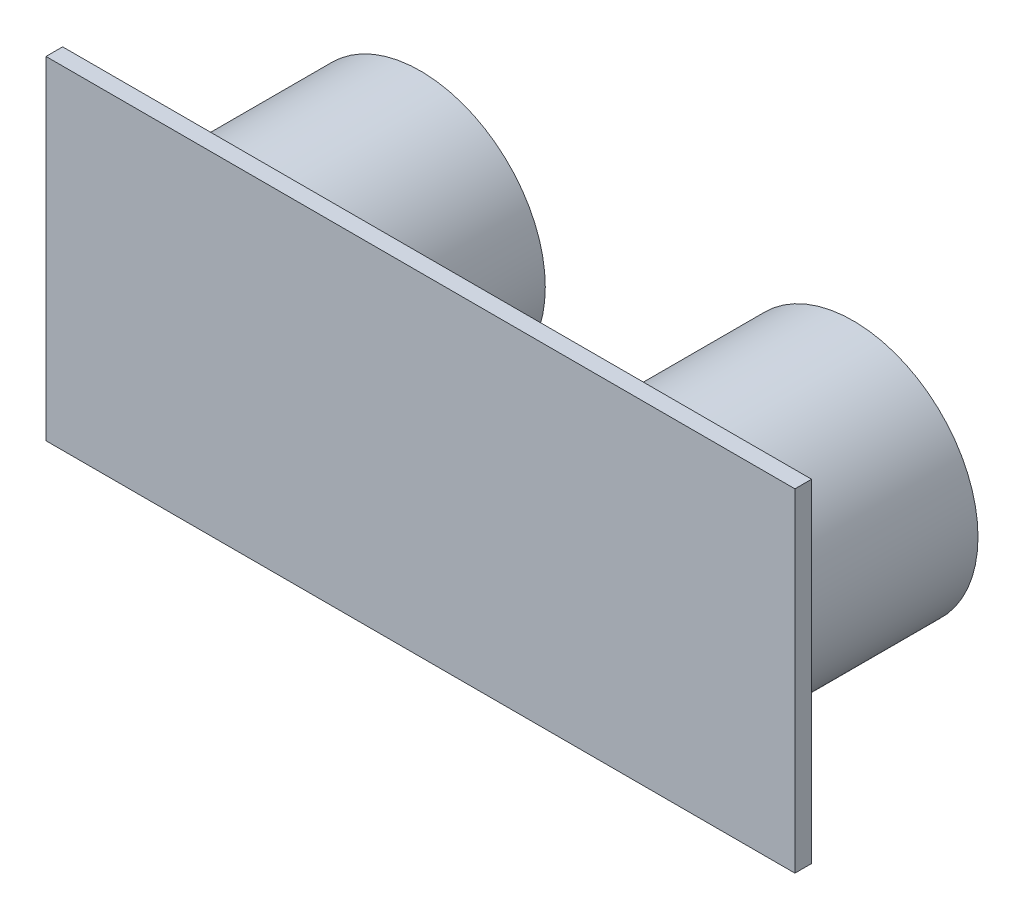
ISO-10303-21;
HEADER;
FILE_DESCRIPTION(('STEP AP214'),'2;1');
FILE_NAME('part.step','',(''),(''),'','','');
FILE_SCHEMA(('AUTOMOTIVE_DESIGN { 1 0 10303 214 1 1 1 1 }'));
ENDSEC;
DATA;
#1=APPLICATION_CONTEXT('core data for automotive mechanical design processes');
#2=APPLICATION_PROTOCOL_DEFINITION('international standard','automotive_design',2000,#1);
#3=PRODUCT_CONTEXT('',#1,'mechanical');
#4=PRODUCT('Part','Part','',(#3));
#5=PRODUCT_RELATED_PRODUCT_CATEGORY('part','',(#4));
#6=PRODUCT_DEFINITION_FORMATION('','',#4);
#7=PRODUCT_DEFINITION_CONTEXT('part definition',#1,'design');
#8=PRODUCT_DEFINITION('design','',#6,#7);
#9=PRODUCT_DEFINITION_SHAPE('','',#8);
#10=(LENGTH_UNIT() NAMED_UNIT(*) SI_UNIT(.MILLI.,.METRE.));
#11=(NAMED_UNIT(*) PLANE_ANGLE_UNIT() SI_UNIT($,.RADIAN.));
#12=(NAMED_UNIT(*) SI_UNIT($,.STERADIAN.) SOLID_ANGLE_UNIT());
#13=UNCERTAINTY_MEASURE_WITH_UNIT(LENGTH_MEASURE(1.E-05),#10,'distance_accuracy_value','');
#14=(GEOMETRIC_REPRESENTATION_CONTEXT(3) GLOBAL_UNCERTAINTY_ASSIGNED_CONTEXT((#13)) GLOBAL_UNIT_ASSIGNED_CONTEXT((#10,
#11,#12)) REPRESENTATION_CONTEXT('',''));
#15=CARTESIAN_POINT('',(0.,0.,0.));
#16=DIRECTION('',(0.,0.,1.));
#17=DIRECTION('',(1.,0.,0.));
#18=AXIS2_PLACEMENT_3D('',#15,#16,#17);
#19=CARTESIAN_POINT('',(-16.4726688102894,2.25884244372991,-12.));
#20=DIRECTION('',(0.,0.,1.));
#21=DIRECTION('',(1.,0.,0.));
#22=AXIS2_PLACEMENT_3D('',#19,#20,#21);
#23=CYLINDRICAL_SURFACE('',#22,6.5);
#24=CARTESIAN_POINT('',(-16.4726688102894,2.25884244372991,-12.));
#25=DIRECTION('',(0.,0.,1.));
#26=DIRECTION('',(1.,0.,0.));
#27=AXIS2_PLACEMENT_3D('',#24,#25,#26);
#28=CIRCLE('',#27,6.5);
#29=CARTESIAN_POINT('',(-9.97266881028938,2.25884244372991,-12.));
#30=VERTEX_POINT('',#29);
#31=EDGE_CURVE('E255',#30,#30,#28,.T.);
#32=ORIENTED_EDGE('',*,*,#31,.F.);
#33=EDGE_LOOP('',(#32));
#34=FACE_BOUND('',#33,.T.);
#35=CARTESIAN_POINT('',(-16.4726688102894,2.25884244372991,-10.));
#36=DIRECTION('',(0.,0.,1.));
#37=DIRECTION('',(1.,0.,0.));
#38=AXIS2_PLACEMENT_3D('',#35,#36,#37);
#39=CIRCLE('',#38,6.5);
#40=CARTESIAN_POINT('',(-9.97266881028938,2.25884244372991,-10.));
#41=VERTEX_POINT('',#40);
#42=EDGE_CURVE('E11',#41,#41,#39,.F.);
#43=ORIENTED_EDGE('',*,*,#42,.F.);
#44=EDGE_LOOP('',(#43));
#45=FACE_BOUND('',#44,.T.);
#46=ADVANCED_FACE('F32',(#34,#45),#23,.F.);
#47=CARTESIAN_POINT('',(9.52733118971062,2.25884244372991,-12.));
#48=DIRECTION('',(0.,0.,1.));
#49=DIRECTION('',(1.,0.,0.));
#50=AXIS2_PLACEMENT_3D('',#47,#48,#49);
#51=CYLINDRICAL_SURFACE('',#50,6.5);
#52=CARTESIAN_POINT('',(9.52733118971062,2.25884244372991,-12.));
#53=DIRECTION('',(0.,0.,1.));
#54=DIRECTION('',(1.,0.,0.));
#55=AXIS2_PLACEMENT_3D('',#52,#53,#54);
#56=CIRCLE('',#55,6.5);
#57=CARTESIAN_POINT('',(16.0273311897106,2.25884244372991,-12.));
#58=VERTEX_POINT('',#57);
#59=EDGE_CURVE('E262',#58,#58,#56,.T.);
#60=ORIENTED_EDGE('',*,*,#59,.F.);
#61=EDGE_LOOP('',(#60));
#62=FACE_BOUND('',#61,.T.);
#63=CARTESIAN_POINT('',(9.52733118971062,2.25884244372991,-10.));
#64=DIRECTION('',(0.,0.,1.));
#65=DIRECTION('',(1.,0.,0.));
#66=AXIS2_PLACEMENT_3D('',#63,#64,#65);
#67=CIRCLE('',#66,6.5);
#68=CARTESIAN_POINT('',(16.0273311897106,2.25884244372991,-10.));
#69=VERTEX_POINT('',#68);
#70=EDGE_CURVE('E41',#69,#69,#67,.F.);
#71=ORIENTED_EDGE('',*,*,#70,.F.);
#72=EDGE_LOOP('',(#71));
#73=FACE_BOUND('',#72,.T.);
#74=ADVANCED_FACE('F114',(#62,#73),#51,.F.);
#75=CARTESIAN_POINT('',(-25.9726688102894,12.2588424437299,1.));
#76=DIRECTION('',(1.,0.,0.));
#77=DIRECTION('',(0.,1.,0.));
#78=AXIS2_PLACEMENT_3D('',#75,#76,#77);
#79=PLANE('',#78);
#80=DIRECTION('',(0.,-1.,0.));
#81=VECTOR('',#80,1.);
#82=CARTESIAN_POINT('',(-25.9726688102894,12.2588424437299,0.));
#83=LINE('',#82,#81);
#84=CARTESIAN_POINT('',(-25.9726688102894,12.2588424437299,0.));
#85=VERTEX_POINT('',#84);
#86=CARTESIAN_POINT('',(-25.9726688102894,-7.74115755627009,0.));
#87=VERTEX_POINT('',#86);
#88=EDGE_CURVE('E100',#85,#87,#83,.T.);
#89=ORIENTED_EDGE('',*,*,#88,.T.);
#90=DIRECTION('',(0.,0.,-1.));
#91=VECTOR('',#90,1.);
#92=CARTESIAN_POINT('',(-25.9726688102894,-7.74115755627009,1.));
#93=LINE('',#92,#91);
#94=CARTESIAN_POINT('',(-25.9726688102894,-7.74115755627009,1.));
#95=VERTEX_POINT('',#94);
#96=EDGE_CURVE('E91',#95,#87,#93,.T.);
#97=ORIENTED_EDGE('',*,*,#96,.F.);
#98=DIRECTION('',(0.,-1.,0.));
#99=VECTOR('',#98,1.);
#100=CARTESIAN_POINT('',(-25.9726688102894,12.2588424437299,1.));
#101=LINE('',#100,#99);
#102=CARTESIAN_POINT('',(-25.9726688102894,12.2588424437299,1.));
#103=VERTEX_POINT('',#102);
#104=EDGE_CURVE('E85',#103,#95,#101,.T.);
#105=ORIENTED_EDGE('',*,*,#104,.F.);
#106=DIRECTION('',(0.,0.,-1.));
#107=VECTOR('',#106,1.);
#108=CARTESIAN_POINT('',(-25.9726688102894,12.2588424437299,1.));
#109=LINE('',#108,#107);
#110=EDGE_CURVE('E96',#103,#85,#109,.T.);
#111=ORIENTED_EDGE('',*,*,#110,.T.);
#112=EDGE_LOOP('',(#89,#97,#105,#111));
#113=FACE_BOUND('',#112,.T.);
#114=ADVANCED_FACE('F34',(#113),#79,.F.);
#115=CARTESIAN_POINT('',(-25.9726688102894,-7.74115755627009,1.));
#116=DIRECTION('',(0.,1.,0.));
#117=DIRECTION('',(0.,0.,1.));
#118=AXIS2_PLACEMENT_3D('',#115,#116,#117);
#119=PLANE('',#118);
#120=DIRECTION('',(1.,0.,0.));
#121=VECTOR('',#120,1.);
#122=CARTESIAN_POINT('',(-25.9726688102894,-7.74115755627009,0.));
#123=LINE('',#122,#121);
#124=CARTESIAN_POINT('',(19.0273311897106,-7.74115755627009,0.));
#125=VERTEX_POINT('',#124);
#126=EDGE_CURVE('E90',#87,#125,#123,.T.);
#127=ORIENTED_EDGE('',*,*,#126,.T.);
#128=DIRECTION('',(0.,0.,-1.));
#129=VECTOR('',#128,1.);
#130=CARTESIAN_POINT('',(19.0273311897106,-7.74115755627009,1.));
#131=LINE('',#130,#129);
#132=CARTESIAN_POINT('',(19.0273311897106,-7.74115755627009,1.));
#133=VERTEX_POINT('',#132);
#134=EDGE_CURVE('E88',#133,#125,#131,.T.);
#135=ORIENTED_EDGE('',*,*,#134,.F.);
#136=DIRECTION('',(1.,0.,0.));
#137=VECTOR('',#136,1.);
#138=CARTESIAN_POINT('',(-25.9726688102894,-7.74115755627009,1.));
#139=LINE('',#138,#137);
#140=EDGE_CURVE('E80',#95,#133,#139,.T.);
#141=ORIENTED_EDGE('',*,*,#140,.F.);
#142=ORIENTED_EDGE('',*,*,#96,.T.);
#143=EDGE_LOOP('',(#127,#135,#141,#142));
#144=FACE_BOUND('',#143,.T.);
#145=ADVANCED_FACE('F89',(#144),#119,.F.);
#146=CARTESIAN_POINT('',(19.0273311897106,12.2588424437299,1.));
#147=DIRECTION('',(-1.,0.,0.));
#148=DIRECTION('',(0.,0.,1.));
#149=AXIS2_PLACEMENT_3D('',#146,#147,#148);
#150=PLANE('',#149);
#151=DIRECTION('',(0.,1.,0.));
#152=VECTOR('',#151,1.);
#153=CARTESIAN_POINT('',(19.0273311897106,12.2588424437299,0.));
#154=LINE('',#153,#152);
#155=CARTESIAN_POINT('',(19.0273311897106,12.2588424437299,0.));
#156=VERTEX_POINT('',#155);
#157=EDGE_CURVE('E66',#125,#156,#154,.T.);
#158=ORIENTED_EDGE('',*,*,#157,.T.);
#159=DIRECTION('',(0.,0.,-1.));
#160=VECTOR('',#159,1.);
#161=CARTESIAN_POINT('',(19.0273311897106,12.2588424437299,1.));
#162=LINE('',#161,#160);
#163=CARTESIAN_POINT('',(19.0273311897106,12.2588424437299,1.));
#164=VERTEX_POINT('',#163);
#165=EDGE_CURVE('E92',#164,#156,#162,.T.);
#166=ORIENTED_EDGE('',*,*,#165,.F.);
#167=DIRECTION('',(0.,1.,0.));
#168=VECTOR('',#167,1.);
#169=CARTESIAN_POINT('',(19.0273311897106,12.2588424437299,1.));
#170=LINE('',#169,#168);
#171=EDGE_CURVE('E83',#133,#164,#170,.T.);
#172=ORIENTED_EDGE('',*,*,#171,.F.);
#173=ORIENTED_EDGE('',*,*,#134,.T.);
#174=EDGE_LOOP('',(#158,#166,#172,#173));
#175=FACE_BOUND('',#174,.T.);
#176=ADVANCED_FACE('F94',(#175),#150,.F.);
#177=CARTESIAN_POINT('',(-25.9726688102894,12.2588424437299,1.));
#178=DIRECTION('',(0.,-1.,0.));
#179=DIRECTION('',(0.,0.,-1.));
#180=AXIS2_PLACEMENT_3D('',#177,#178,#179);
#181=PLANE('',#180);
#182=DIRECTION('',(-1.,0.,0.));
#183=VECTOR('',#182,1.);
#184=CARTESIAN_POINT('',(-25.9726688102894,12.2588424437299,0.));
#185=LINE('',#184,#183);
#186=EDGE_CURVE('E72',#156,#85,#185,.T.);
#187=ORIENTED_EDGE('',*,*,#186,.T.);
#188=ORIENTED_EDGE('',*,*,#110,.F.);
#189=DIRECTION('',(-1.,0.,0.));
#190=VECTOR('',#189,1.);
#191=CARTESIAN_POINT('',(-25.9726688102894,12.2588424437299,1.));
#192=LINE('',#191,#190);
#193=EDGE_CURVE('E49',#164,#103,#192,.T.);
#194=ORIENTED_EDGE('',*,*,#193,.F.);
#195=ORIENTED_EDGE('',*,*,#165,.T.);
#196=EDGE_LOOP('',(#187,#188,#194,#195));
#197=FACE_BOUND('',#196,.T.);
#198=ADVANCED_FACE('F148',(#197),#181,.F.);
#199=CARTESIAN_POINT('',(0.,0.,1.));
#200=DIRECTION('',(0.,0.,1.));
#201=DIRECTION('',(1.,0.,0.));
#202=AXIS2_PLACEMENT_3D('',#199,#200,#201);
#203=PLANE('',#202);
#204=ORIENTED_EDGE('',*,*,#104,.T.);
#205=ORIENTED_EDGE('',*,*,#140,.T.);
#206=ORIENTED_EDGE('',*,*,#171,.T.);
#207=ORIENTED_EDGE('',*,*,#193,.T.);
#208=EDGE_LOOP('',(#204,#205,#206,#207));
#209=FACE_BOUND('',#208,.T.);
#210=ADVANCED_FACE('F81',(#209),#203,.T.);
#211=CARTESIAN_POINT('',(0.,0.,0.));
#212=DIRECTION('',(0.,0.,1.));
#213=DIRECTION('',(1.,0.,0.));
#214=AXIS2_PLACEMENT_3D('',#211,#212,#213);
#215=PLANE('',#214);
#216=CARTESIAN_POINT('',(9.52733118971062,2.25884244372991,0.));
#217=DIRECTION('',(0.,0.,1.));
#218=DIRECTION('',(1.,0.,0.));
#219=AXIS2_PLACEMENT_3D('',#216,#217,#218);
#220=CIRCLE('',#219,7.5);
#221=CARTESIAN_POINT('',(17.0273311897106,2.25884244372991,0.));
#222=VERTEX_POINT('',#221);
#223=EDGE_CURVE('E247',#222,#222,#220,.T.);
#224=ORIENTED_EDGE('',*,*,#223,.T.);
#225=EDGE_LOOP('',(#224));
#226=FACE_BOUND('',#225,.T.);
#227=CARTESIAN_POINT('',(-16.4726688102894,2.25884244372991,0.));
#228=DIRECTION('',(0.,0.,1.));
#229=DIRECTION('',(1.,0.,0.));
#230=AXIS2_PLACEMENT_3D('',#227,#228,#229);
#231=CIRCLE('',#230,7.5);
#232=CARTESIAN_POINT('',(-8.97266881028938,2.25884244372991,0.));
#233=VERTEX_POINT('',#232);
#234=EDGE_CURVE('E251',#233,#233,#231,.T.);
#235=ORIENTED_EDGE('',*,*,#234,.T.);
#236=EDGE_LOOP('',(#235));
#237=FACE_BOUND('',#236,.T.);
#238=ORIENTED_EDGE('',*,*,#88,.F.);
#239=ORIENTED_EDGE('',*,*,#186,.F.);
#240=ORIENTED_EDGE('',*,*,#157,.F.);
#241=ORIENTED_EDGE('',*,*,#126,.F.);
#242=EDGE_LOOP('',(#238,#239,#240,#241));
#243=FACE_BOUND('',#242,.T.);
#244=ADVANCED_FACE('F144',(#226,#237,#243),#215,.F.);
#245=CARTESIAN_POINT('',(-16.4726688102894,2.25884244372991,-12.));
#246=DIRECTION('',(0.,0.,1.));
#247=DIRECTION('',(1.,0.,0.));
#248=AXIS2_PLACEMENT_3D('',#245,#246,#247);
#249=CYLINDRICAL_SURFACE('',#248,7.5);
#250=CARTESIAN_POINT('',(-16.4726688102894,2.25884244372991,-12.));
#251=DIRECTION('',(0.,0.,1.));
#252=DIRECTION('',(1.,0.,0.));
#253=AXIS2_PLACEMENT_3D('',#250,#251,#252);
#254=CIRCLE('',#253,7.5);
#255=CARTESIAN_POINT('',(-8.97266881028938,2.25884244372991,-12.));
#256=VERTEX_POINT('',#255);
#257=EDGE_CURVE('E103',#256,#256,#254,.T.);
#258=ORIENTED_EDGE('',*,*,#257,.T.);
#259=EDGE_LOOP('',(#258));
#260=FACE_BOUND('',#259,.T.);
#261=ORIENTED_EDGE('',*,*,#234,.F.);
#262=EDGE_LOOP('',(#261));
#263=FACE_BOUND('',#262,.T.);
#264=ADVANCED_FACE('F140',(#260,#263),#249,.T.);
#265=CARTESIAN_POINT('',(-16.4726688102894,2.25884244372991,-12.));
#266=DIRECTION('',(0.,0.,1.));
#267=DIRECTION('',(1.,0.,0.));
#268=AXIS2_PLACEMENT_3D('',#265,#266,#267);
#269=PLANE('',#268);
#270=ORIENTED_EDGE('',*,*,#31,.T.);
#271=EDGE_LOOP('',(#270));
#272=FACE_BOUND('',#271,.T.);
#273=ORIENTED_EDGE('',*,*,#257,.F.);
#274=EDGE_LOOP('',(#273));
#275=FACE_BOUND('',#274,.T.);
#276=ADVANCED_FACE('F135',(#272,#275),#269,.F.);
#277=CARTESIAN_POINT('',(9.52733118971062,2.25884244372991,-12.));
#278=DIRECTION('',(0.,0.,1.));
#279=DIRECTION('',(1.,0.,0.));
#280=AXIS2_PLACEMENT_3D('',#277,#278,#279);
#281=CYLINDRICAL_SURFACE('',#280,7.5);
#282=CARTESIAN_POINT('',(9.52733118971062,2.25884244372991,-12.));
#283=DIRECTION('',(0.,0.,1.));
#284=DIRECTION('',(1.,0.,0.));
#285=AXIS2_PLACEMENT_3D('',#282,#283,#284);
#286=CIRCLE('',#285,7.5);
#287=CARTESIAN_POINT('',(17.0273311897106,2.25884244372991,-12.));
#288=VERTEX_POINT('',#287);
#289=EDGE_CURVE('E260',#288,#288,#286,.T.);
#290=ORIENTED_EDGE('',*,*,#289,.T.);
#291=EDGE_LOOP('',(#290));
#292=FACE_BOUND('',#291,.T.);
#293=ORIENTED_EDGE('',*,*,#223,.F.);
#294=EDGE_LOOP('',(#293));
#295=FACE_BOUND('',#294,.T.);
#296=ADVANCED_FACE('F132',(#292,#295),#281,.T.);
#297=CARTESIAN_POINT('',(9.52733118971062,2.25884244372991,-12.));
#298=DIRECTION('',(0.,0.,1.));
#299=DIRECTION('',(1.,0.,0.));
#300=AXIS2_PLACEMENT_3D('',#297,#298,#299);
#301=PLANE('',#300);
#302=ORIENTED_EDGE('',*,*,#59,.T.);
#303=EDGE_LOOP('',(#302));
#304=FACE_BOUND('',#303,.T.);
#305=ORIENTED_EDGE('',*,*,#289,.F.);
#306=EDGE_LOOP('',(#305));
#307=FACE_BOUND('',#306,.T.);
#308=ADVANCED_FACE('F129',(#304,#307),#301,.F.);
#309=CARTESIAN_POINT('',(9.52733118971062,2.25884244372991,-10.));
#310=DIRECTION('',(0.,0.,1.));
#311=DIRECTION('',(1.,0.,0.));
#312=AXIS2_PLACEMENT_3D('',#309,#310,#311);
#313=PLANE('',#312);
#314=ORIENTED_EDGE('',*,*,#70,.T.);
#315=EDGE_LOOP('',(#314));
#316=FACE_BOUND('',#315,.T.);
#317=ADVANCED_FACE('F112',(#316),#313,.F.);
#318=CARTESIAN_POINT('',(-16.4726688102894,2.25884244372991,-10.));
#319=DIRECTION('',(0.,0.,1.));
#320=DIRECTION('',(1.,0.,0.));
#321=AXIS2_PLACEMENT_3D('',#318,#319,#320);
#322=PLANE('',#321);
#323=ORIENTED_EDGE('',*,*,#42,.T.);
#324=EDGE_LOOP('',(#323));
#325=FACE_BOUND('',#324,.T.);
#326=ADVANCED_FACE('F199',(#325),#322,.F.);
#327=CLOSED_SHELL('',(#46,#74,#114,#145,#176,#198,#210,#244,#264,#276,#296,#308,#317,#326));
#328=MANIFOLD_SOLID_BREP('B2',#327);
#329=ADVANCED_BREP_SHAPE_REPRESENTATION('',(#18,#328),#14);
#330=SHAPE_DEFINITION_REPRESENTATION(#9,#329);
ENDSEC;
END-ISO-10303-21;
